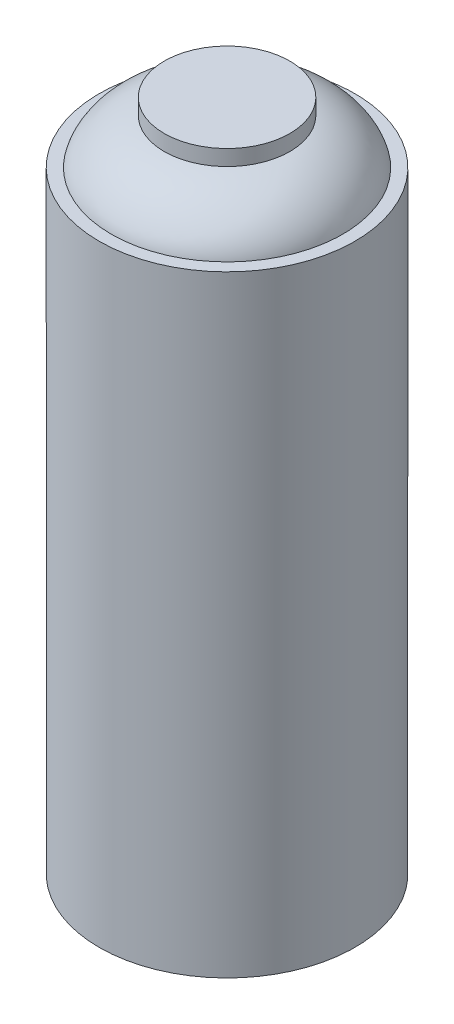
ISO-10303-21;
HEADER;
FILE_DESCRIPTION(('STEP AP214'),'2;1');
FILE_NAME('part.step','',(''),(''),'','','');
FILE_SCHEMA(('AUTOMOTIVE_DESIGN { 1 0 10303 214 1 1 1 1 }'));
ENDSEC;
DATA;
#1=APPLICATION_CONTEXT('core data for automotive mechanical design processes');
#2=APPLICATION_PROTOCOL_DEFINITION('international standard','automotive_design',2000,#1);
#3=PRODUCT_CONTEXT('',#1,'mechanical');
#4=PRODUCT('Part','Part','',(#3));
#5=PRODUCT_RELATED_PRODUCT_CATEGORY('part','',(#4));
#6=PRODUCT_DEFINITION_FORMATION('','',#4);
#7=PRODUCT_DEFINITION_CONTEXT('part definition',#1,'design');
#8=PRODUCT_DEFINITION('design','',#6,#7);
#9=PRODUCT_DEFINITION_SHAPE('','',#8);
#10=(LENGTH_UNIT() NAMED_UNIT(*) SI_UNIT(.MILLI.,.METRE.));
#11=(NAMED_UNIT(*) PLANE_ANGLE_UNIT() SI_UNIT($,.RADIAN.));
#12=(NAMED_UNIT(*) SI_UNIT($,.STERADIAN.) SOLID_ANGLE_UNIT());
#13=UNCERTAINTY_MEASURE_WITH_UNIT(LENGTH_MEASURE(1.E-05),#10,'distance_accuracy_value','');
#14=(GEOMETRIC_REPRESENTATION_CONTEXT(3) GLOBAL_UNCERTAINTY_ASSIGNED_CONTEXT((#13)) GLOBAL_UNIT_ASSIGNED_CONTEXT((#10,
#11,#12)) REPRESENTATION_CONTEXT('',''));
#15=CARTESIAN_POINT('',(0.,0.,0.));
#16=DIRECTION('',(0.,0.,1.));
#17=DIRECTION('',(1.,0.,0.));
#18=AXIS2_PLACEMENT_3D('',#15,#16,#17);
#19=CARTESIAN_POINT('',(16.225,102.290424394641,0.));
#20=DIRECTION('',(0.,-1.,0.));
#21=DIRECTION('',(0.,0.,-1.));
#22=AXIS2_PLACEMENT_3D('',#19,#20,#21);
#23=PLANE('',#22);
#24=CARTESIAN_POINT('',(0.,102.290424394641,0.));
#25=DIRECTION('',(0.,1.,0.));
#26=DIRECTION('',(0.,0.,1.));
#27=AXIS2_PLACEMENT_3D('',#24,#25,#26);
#28=CIRCLE('',#27,16.225);
#29=CARTESIAN_POINT('',(0.,102.290424394641,16.225));
#30=VERTEX_POINT('',#29);
#31=EDGE_CURVE('E10',#30,#30,#28,.T.);
#32=ORIENTED_EDGE('',*,*,#31,.T.);
#33=EDGE_LOOP('',(#32));
#34=FACE_BOUND('',#33,.T.);
#35=ADVANCED_FACE('F39',(#34),#23,.F.);
#36=CARTESIAN_POINT('',(0.,102.290424394641,0.));
#37=DIRECTION('',(0.,1.,0.));
#38=DIRECTION('',(0.,0.,1.));
#39=AXIS2_PLACEMENT_3D('',#36,#37,#38);
#40=CYLINDRICAL_SURFACE('',#39,16.225);
#41=ORIENTED_EDGE('',*,*,#31,.F.);
#42=EDGE_LOOP('',(#41));
#43=FACE_BOUND('',#42,.T.);
#44=CARTESIAN_POINT('',(0.,98.2504243946414,0.));
#45=DIRECTION('',(0.,1.,0.));
#46=DIRECTION('',(0.,0.,1.));
#47=AXIS2_PLACEMENT_3D('',#44,#45,#46);
#48=CIRCLE('',#47,16.225);
#49=CARTESIAN_POINT('',(0.,98.2504243946414,16.225));
#50=VERTEX_POINT('',#49);
#51=EDGE_CURVE('E45',#50,#50,#48,.T.);
#52=ORIENTED_EDGE('',*,*,#51,.T.);
#53=EDGE_LOOP('',(#52));
#54=FACE_BOUND('',#53,.T.);
#55=ADVANCED_FACE('F72',(#43,#54),#40,.T.);
#56=CARTESIAN_POINT('',(29.9,86.5904243946414,0.));
#57=CARTESIAN_POINT('',(28.948018921423,91.0518609090001,0.));
#58=CARTESIAN_POINT('',(23.9312120426774,96.61726819376,0.));
#59=CARTESIAN_POINT('',(16.225,98.2504243946414,0.));
#60=B_SPLINE_CURVE_WITH_KNOTS('',3,(#56,#57,#58,#59),.UNSPECIFIED.,.F.,.F.,(4,4),(0.,1.),.UNSPECIFIED.);
#61=CARTESIAN_POINT('',(0.,102.290424394641,0.));
#62=DIRECTION('',(0.,1.,0.));
#63=AXIS1_PLACEMENT('',#61,#62);
#64=SURFACE_OF_REVOLUTION('',#60,#63);
#65=ORIENTED_EDGE('',*,*,#51,.F.);
#66=EDGE_LOOP('',(#65));
#67=FACE_BOUND('',#66,.T.);
#68=CARTESIAN_POINT('',(0.,86.5904243946414,0.));
#69=DIRECTION('',(0.,1.,0.));
#70=DIRECTION('',(0.,0.,1.));
#71=AXIS2_PLACEMENT_3D('',#68,#69,#70);
#72=CIRCLE('',#71,29.9);
#73=CARTESIAN_POINT('',(0.,86.5904243946414,29.9));
#74=VERTEX_POINT('',#73);
#75=EDGE_CURVE('E49',#74,#74,#72,.T.);
#76=ORIENTED_EDGE('',*,*,#75,.T.);
#77=EDGE_LOOP('',(#76));
#78=FACE_BOUND('',#77,.T.);
#79=ADVANCED_FACE('F68',(#67,#78),#64,.T.);
#80=CARTESIAN_POINT('',(33.04,86.5904243946414,0.));
#81=DIRECTION('',(0.,-1.,0.));
#82=DIRECTION('',(0.,0.,-1.));
#83=AXIS2_PLACEMENT_3D('',#80,#81,#82);
#84=PLANE('',#83);
#85=ORIENTED_EDGE('',*,*,#75,.F.);
#86=EDGE_LOOP('',(#85));
#87=FACE_BOUND('',#86,.T.);
#88=CARTESIAN_POINT('',(0.,86.5904243946414,0.));
#89=DIRECTION('',(0.,1.,0.));
#90=DIRECTION('',(0.,0.,1.));
#91=AXIS2_PLACEMENT_3D('',#88,#89,#90);
#92=CIRCLE('',#91,33.04);
#93=CARTESIAN_POINT('',(0.,86.5904243946414,33.04));
#94=VERTEX_POINT('',#93);
#95=EDGE_CURVE('E53',#94,#94,#92,.T.);
#96=ORIENTED_EDGE('',*,*,#95,.T.);
#97=EDGE_LOOP('',(#96));
#98=FACE_BOUND('',#97,.T.);
#99=ADVANCED_FACE('F71',(#87,#98),#84,.F.);
#100=CARTESIAN_POINT('',(0.,102.290424394641,0.));
#101=DIRECTION('',(0.,1.,0.));
#102=DIRECTION('',(0.,0.,1.));
#103=AXIS2_PLACEMENT_3D('',#100,#101,#102);
#104=CYLINDRICAL_SURFACE('',#103,33.04);
#105=ORIENTED_EDGE('',*,*,#95,.F.);
#106=EDGE_LOOP('',(#105));
#107=FACE_BOUND('',#106,.T.);
#108=CARTESIAN_POINT('',(0.,-71.4095756053586,0.));
#109=DIRECTION('',(0.,1.,0.));
#110=DIRECTION('',(0.,0.,1.));
#111=AXIS2_PLACEMENT_3D('',#108,#109,#110);
#112=CIRCLE('',#111,33.04);
#113=CARTESIAN_POINT('',(0.,-71.4095756053586,33.04));
#114=VERTEX_POINT('',#113);
#115=EDGE_CURVE('E58',#114,#114,#112,.T.);
#116=ORIENTED_EDGE('',*,*,#115,.T.);
#117=EDGE_LOOP('',(#116));
#118=FACE_BOUND('',#117,.T.);
#119=ADVANCED_FACE('F102',(#107,#118),#104,.T.);
#120=CARTESIAN_POINT('',(0.,-143.809611702128,0.));
#121=DIRECTION('',(0.,1.,0.));
#122=DIRECTION('',(-1.,0.,0.));
#123=AXIS2_PLACEMENT_3D('',#120,#121,#122);
#124=SPHERICAL_SURFACE('',#123,79.5827043195538);
#125=ORIENTED_EDGE('',*,*,#115,.F.);
#126=EDGE_LOOP('',(#125));
#127=FACE_BOUND('',#126,.T.);
#128=ADVANCED_FACE('F111',(#127),#124,.F.);
#129=CLOSED_SHELL('',(#35,#55,#79,#99,#119,#128));
#130=MANIFOLD_SOLID_BREP('B2',#129);
#131=ADVANCED_BREP_SHAPE_REPRESENTATION('',(#18,#130),#14);
#132=SHAPE_DEFINITION_REPRESENTATION(#9,#131);
ENDSEC;
END-ISO-10303-21;
